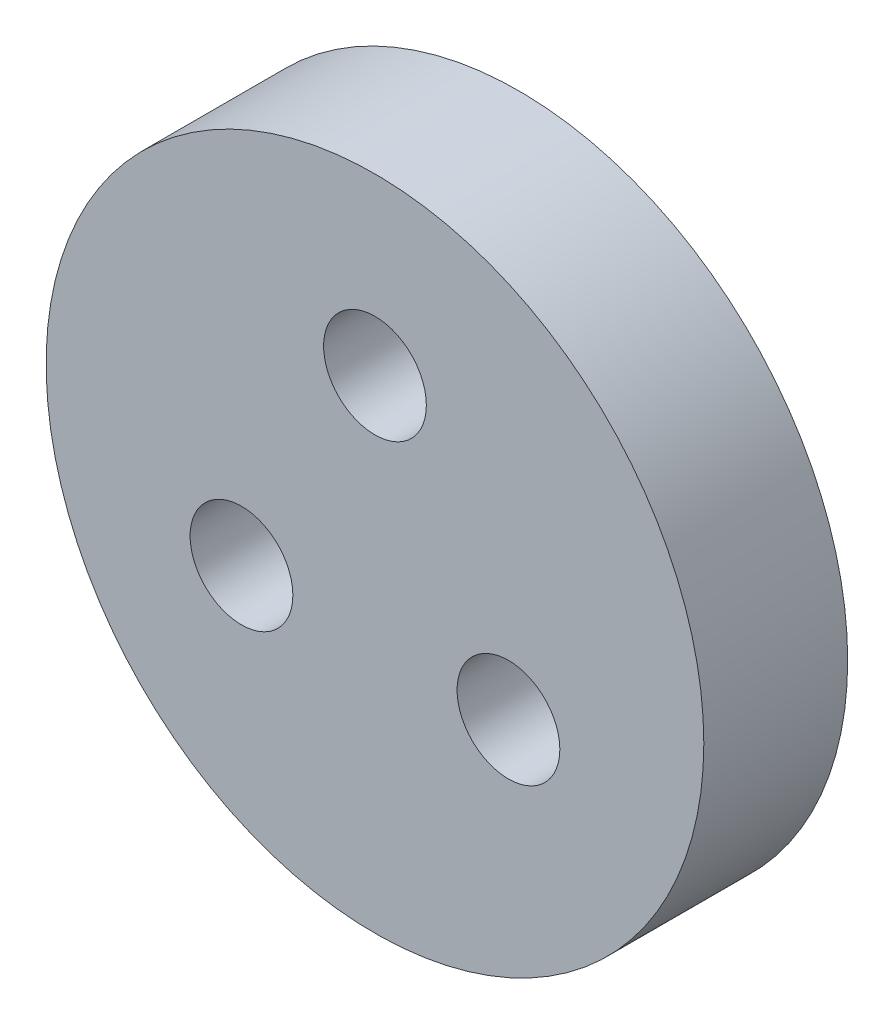
ISO-10303-21;
HEADER;
FILE_DESCRIPTION(('STEP AP214'),'2;1');
FILE_NAME('part.step','',(''),(''),'','','');
FILE_SCHEMA(('AUTOMOTIVE_DESIGN { 1 0 10303 214 1 1 1 1 }'));
ENDSEC;
DATA;
#1=APPLICATION_CONTEXT('core data for automotive mechanical design processes');
#2=APPLICATION_PROTOCOL_DEFINITION('international standard','automotive_design',2000,#1);
#3=PRODUCT_CONTEXT('',#1,'mechanical');
#4=PRODUCT('Part','Part','',(#3));
#5=PRODUCT_RELATED_PRODUCT_CATEGORY('part','',(#4));
#6=PRODUCT_DEFINITION_FORMATION('','',#4);
#7=PRODUCT_DEFINITION_CONTEXT('part definition',#1,'design');
#8=PRODUCT_DEFINITION('design','',#6,#7);
#9=PRODUCT_DEFINITION_SHAPE('','',#8);
#10=(LENGTH_UNIT() NAMED_UNIT(*) SI_UNIT(.MILLI.,.METRE.));
#11=(NAMED_UNIT(*) PLANE_ANGLE_UNIT() SI_UNIT($,.RADIAN.));
#12=(NAMED_UNIT(*) SI_UNIT($,.STERADIAN.) SOLID_ANGLE_UNIT());
#13=UNCERTAINTY_MEASURE_WITH_UNIT(LENGTH_MEASURE(1.E-05),#10,'distance_accuracy_value','');
#14=(GEOMETRIC_REPRESENTATION_CONTEXT(3) GLOBAL_UNCERTAINTY_ASSIGNED_CONTEXT((#13)) GLOBAL_UNIT_ASSIGNED_CONTEXT((#10,
#11,#12)) REPRESENTATION_CONTEXT('',''));
#15=CARTESIAN_POINT('',(0.,0.,0.));
#16=DIRECTION('',(0.,0.,1.));
#17=DIRECTION('',(1.,0.,0.));
#18=AXIS2_PLACEMENT_3D('',#15,#16,#17);
#19=CARTESIAN_POINT('',(-46.7307364964012,-71.8640520639294,3.5));
#20=DIRECTION('',(0.,0.,-1.));
#21=DIRECTION('',(-1.,0.,0.));
#22=AXIS2_PLACEMENT_3D('',#19,#20,#21);
#23=CYLINDRICAL_SURFACE('',#22,1.25);
#24=CARTESIAN_POINT('',(-46.7307364964012,-71.8640520639294,3.5));
#25=DIRECTION('',(0.,0.,1.));
#26=DIRECTION('',(1.,0.,0.));
#27=AXIS2_PLACEMENT_3D('',#24,#25,#26);
#28=CIRCLE('',#27,1.25);
#29=CARTESIAN_POINT('',(-45.4807364964012,-71.8640520639294,3.5));
#30=VERTEX_POINT('',#29);
#31=EDGE_CURVE('E43',#30,#30,#28,.T.);
#32=ORIENTED_EDGE('',*,*,#31,.T.);
#33=EDGE_LOOP('',(#32));
#34=FACE_BOUND('',#33,.T.);
#35=CARTESIAN_POINT('',(-46.7307364964012,-71.8640520639294,0.));
#36=DIRECTION('',(0.,0.,1.));
#37=DIRECTION('',(1.,0.,0.));
#38=AXIS2_PLACEMENT_3D('',#35,#36,#37);
#39=CIRCLE('',#38,1.25);
#40=CARTESIAN_POINT('',(-45.4807364964012,-71.8640520639294,0.));
#41=VERTEX_POINT('',#40);
#42=EDGE_CURVE('E59',#41,#41,#39,.T.);
#43=ORIENTED_EDGE('',*,*,#42,.F.);
#44=EDGE_LOOP('',(#43));
#45=FACE_BOUND('',#44,.T.);
#46=ADVANCED_FACE('F32',(#34,#45),#23,.F.);
#47=CARTESIAN_POINT('',(-43.4831412322115,-66.2390520639304,3.5));
#48=DIRECTION('',(0.,0.,-1.));
#49=DIRECTION('',(-1.,0.,0.));
#50=AXIS2_PLACEMENT_3D('',#47,#48,#49);
#51=CYLINDRICAL_SURFACE('',#50,1.25);
#52=CARTESIAN_POINT('',(-43.4831412322115,-66.2390520639304,3.5));
#53=DIRECTION('',(0.,0.,1.));
#54=DIRECTION('',(1.,0.,0.));
#55=AXIS2_PLACEMENT_3D('',#52,#53,#54);
#56=CIRCLE('',#55,1.25);
#57=CARTESIAN_POINT('',(-42.2331412322115,-66.2390520639304,3.5));
#58=VERTEX_POINT('',#57);
#59=EDGE_CURVE('E48',#58,#58,#56,.T.);
#60=ORIENTED_EDGE('',*,*,#59,.T.);
#61=EDGE_LOOP('',(#60));
#62=FACE_BOUND('',#61,.T.);
#63=CARTESIAN_POINT('',(-43.4831412322115,-66.2390520639304,0.));
#64=DIRECTION('',(0.,0.,1.));
#65=DIRECTION('',(1.,0.,0.));
#66=AXIS2_PLACEMENT_3D('',#63,#64,#65);
#67=CIRCLE('',#66,1.25);
#68=CARTESIAN_POINT('',(-42.2331412322115,-66.2390520639304,0.));
#69=VERTEX_POINT('',#68);
#70=EDGE_CURVE('E55',#69,#69,#67,.T.);
#71=ORIENTED_EDGE('',*,*,#70,.F.);
#72=EDGE_LOOP('',(#71));
#73=FACE_BOUND('',#72,.T.);
#74=ADVANCED_FACE('F91',(#62,#73),#51,.F.);
#75=CARTESIAN_POINT('',(-40.2355459680198,-71.8640520639283,3.5));
#76=DIRECTION('',(0.,0.,-1.));
#77=DIRECTION('',(-1.,0.,0.));
#78=AXIS2_PLACEMENT_3D('',#75,#76,#77);
#79=CYLINDRICAL_SURFACE('',#78,1.25);
#80=CARTESIAN_POINT('',(-40.2355459680198,-71.8640520639283,3.5));
#81=DIRECTION('',(0.,0.,1.));
#82=DIRECTION('',(1.,0.,0.));
#83=AXIS2_PLACEMENT_3D('',#80,#81,#82);
#84=CIRCLE('',#83,1.25);
#85=CARTESIAN_POINT('',(-38.9855459680198,-71.8640520639283,3.5));
#86=VERTEX_POINT('',#85);
#87=EDGE_CURVE('E63',#86,#86,#84,.T.);
#88=ORIENTED_EDGE('',*,*,#87,.T.);
#89=EDGE_LOOP('',(#88));
#90=FACE_BOUND('',#89,.T.);
#91=CARTESIAN_POINT('',(-40.2355459680198,-71.8640520639283,0.));
#92=DIRECTION('',(0.,0.,1.));
#93=DIRECTION('',(1.,0.,0.));
#94=AXIS2_PLACEMENT_3D('',#91,#92,#93);
#95=CIRCLE('',#94,1.25);
#96=CARTESIAN_POINT('',(-38.9855459680198,-71.8640520639283,0.));
#97=VERTEX_POINT('',#96);
#98=EDGE_CURVE('E52',#97,#97,#95,.T.);
#99=ORIENTED_EDGE('',*,*,#98,.F.);
#100=EDGE_LOOP('',(#99));
#101=FACE_BOUND('',#100,.T.);
#102=ADVANCED_FACE('F34',(#90,#101),#79,.F.);
#103=CARTESIAN_POINT('',(-43.4831412322115,-69.9890520639301,3.5));
#104=DIRECTION('',(0.,0.,-1.));
#105=DIRECTION('',(-1.,0.,0.));
#106=AXIS2_PLACEMENT_3D('',#103,#104,#105);
#107=CYLINDRICAL_SURFACE('',#106,8.);
#108=CARTESIAN_POINT('',(-43.4831412322115,-69.9890520639301,3.5));
#109=DIRECTION('',(0.,0.,1.));
#110=DIRECTION('',(1.,0.,0.));
#111=AXIS2_PLACEMENT_3D('',#108,#109,#110);
#112=CIRCLE('',#111,8.);
#113=CARTESIAN_POINT('',(-35.4831412322115,-69.9890520639301,3.5));
#114=VERTEX_POINT('',#113);
#115=EDGE_CURVE('E39',#114,#114,#112,.T.);
#116=ORIENTED_EDGE('',*,*,#115,.F.);
#117=EDGE_LOOP('',(#116));
#118=FACE_BOUND('',#117,.T.);
#119=CARTESIAN_POINT('',(-43.4831412322115,-69.9890520639301,0.));
#120=DIRECTION('',(0.,0.,1.));
#121=DIRECTION('',(1.,0.,0.));
#122=AXIS2_PLACEMENT_3D('',#119,#120,#121);
#123=CIRCLE('',#122,8.);
#124=CARTESIAN_POINT('',(-35.4831412322115,-69.9890520639301,0.));
#125=VERTEX_POINT('',#124);
#126=EDGE_CURVE('E61',#125,#125,#123,.T.);
#127=ORIENTED_EDGE('',*,*,#126,.T.);
#128=EDGE_LOOP('',(#127));
#129=FACE_BOUND('',#128,.T.);
#130=ADVANCED_FACE('F100',(#118,#129),#107,.T.);
#131=CARTESIAN_POINT('',(0.,0.,3.5));
#132=DIRECTION('',(0.,0.,1.));
#133=DIRECTION('',(1.,0.,0.));
#134=AXIS2_PLACEMENT_3D('',#131,#132,#133);
#135=PLANE('',#134);
#136=ORIENTED_EDGE('',*,*,#87,.F.);
#137=EDGE_LOOP('',(#136));
#138=FACE_BOUND('',#137,.T.);
#139=ORIENTED_EDGE('',*,*,#59,.F.);
#140=EDGE_LOOP('',(#139));
#141=FACE_BOUND('',#140,.T.);
#142=ORIENTED_EDGE('',*,*,#31,.F.);
#143=EDGE_LOOP('',(#142));
#144=FACE_BOUND('',#143,.T.);
#145=ORIENTED_EDGE('',*,*,#115,.T.);
#146=EDGE_LOOP('',(#145));
#147=FACE_BOUND('',#146,.T.);
#148=ADVANCED_FACE('F86',(#138,#141,#144,#147),#135,.T.);
#149=CARTESIAN_POINT('',(0.,0.,0.));
#150=DIRECTION('',(0.,0.,1.));
#151=DIRECTION('',(1.,0.,0.));
#152=AXIS2_PLACEMENT_3D('',#149,#150,#151);
#153=PLANE('',#152);
#154=CARTESIAN_POINT('',(-43.4831412322115,-69.9890520639301,0.));
#155=DIRECTION('',(0.,0.,1.));
#156=DIRECTION('',(1.,0.,0.));
#157=AXIS2_PLACEMENT_3D('',#154,#155,#156);
#158=CIRCLE('',#157,1.5);
#159=CARTESIAN_POINT('',(-41.9831412322115,-69.9890520639301,0.));
#160=VERTEX_POINT('',#159);
#161=EDGE_CURVE('E10',#160,#160,#158,.F.);
#162=ORIENTED_EDGE('',*,*,#161,.F.);
#163=EDGE_LOOP('',(#162));
#164=FACE_BOUND('',#163,.T.);
#165=ORIENTED_EDGE('',*,*,#98,.T.);
#166=EDGE_LOOP('',(#165));
#167=FACE_BOUND('',#166,.T.);
#168=ORIENTED_EDGE('',*,*,#70,.T.);
#169=EDGE_LOOP('',(#168));
#170=FACE_BOUND('',#169,.T.);
#171=ORIENTED_EDGE('',*,*,#42,.T.);
#172=EDGE_LOOP('',(#171));
#173=FACE_BOUND('',#172,.T.);
#174=ORIENTED_EDGE('',*,*,#126,.F.);
#175=EDGE_LOOP('',(#174));
#176=FACE_BOUND('',#175,.T.);
#177=ADVANCED_FACE('F79',(#164,#167,#170,#173,#176),#153,.F.);
#178=CARTESIAN_POINT('',(-43.4831412322115,-69.9890520639301,-2.));
#179=DIRECTION('',(0.,0.,1.));
#180=DIRECTION('',(1.,0.,0.));
#181=AXIS2_PLACEMENT_3D('',#178,#179,#180);
#182=CYLINDRICAL_SURFACE('',#181,1.5);
#183=CARTESIAN_POINT('',(-43.4831412322115,-69.9890520639301,-2.));
#184=DIRECTION('',(0.,0.,-1.));
#185=DIRECTION('',(-1.,0.,0.));
#186=AXIS2_PLACEMENT_3D('',#183,#184,#185);
#187=CIRCLE('',#186,1.5);
#188=CARTESIAN_POINT('',(-44.9831412322115,-69.9890520639301,-2.));
#189=VERTEX_POINT('',#188);
#190=EDGE_CURVE('E56',#189,#189,#187,.T.);
#191=ORIENTED_EDGE('',*,*,#190,.F.);
#192=EDGE_LOOP('',(#191));
#193=FACE_BOUND('',#192,.T.);
#194=ORIENTED_EDGE('',*,*,#161,.T.);
#195=EDGE_LOOP('',(#194));
#196=FACE_BOUND('',#195,.T.);
#197=ADVANCED_FACE('F77',(#193,#196),#182,.T.);
#198=CARTESIAN_POINT('',(-43.4831412322115,-69.9890520639301,-2.));
#199=DIRECTION('',(0.,0.,-1.));
#200=DIRECTION('',(-1.,0.,0.));
#201=AXIS2_PLACEMENT_3D('',#198,#199,#200);
#202=PLANE('',#201);
#203=ORIENTED_EDGE('',*,*,#190,.T.);
#204=EDGE_LOOP('',(#203));
#205=FACE_BOUND('',#204,.T.);
#206=ADVANCED_FACE('F75',(#205),#202,.T.);
#207=CLOSED_SHELL('',(#46,#74,#102,#130,#148,#177,#197,#206));
#208=MANIFOLD_SOLID_BREP('B2',#207);
#209=ADVANCED_BREP_SHAPE_REPRESENTATION('',(#18,#208),#14);
#210=SHAPE_DEFINITION_REPRESENTATION(#9,#209);
ENDSEC;
END-ISO-10303-21;
